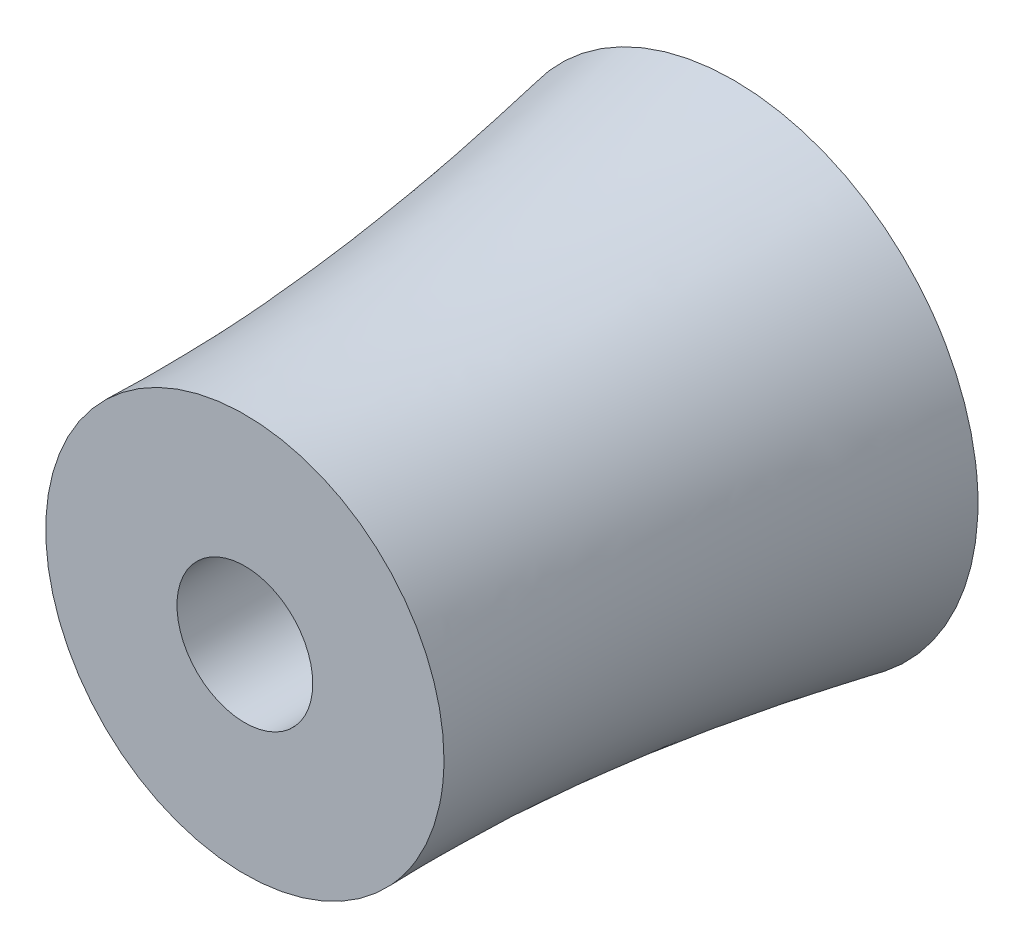
ISO-10303-21;
HEADER;
FILE_DESCRIPTION(('STEP AP214'),'2;1');
FILE_NAME('part.step','',(''),(''),'','','');
FILE_SCHEMA(('AUTOMOTIVE_DESIGN { 1 0 10303 214 1 1 1 1 }'));
ENDSEC;
DATA;
#1=APPLICATION_CONTEXT('core data for automotive mechanical design processes');
#2=APPLICATION_PROTOCOL_DEFINITION('international standard','automotive_design',2000,#1);
#3=PRODUCT_CONTEXT('',#1,'mechanical');
#4=PRODUCT('Part','Part','',(#3));
#5=PRODUCT_RELATED_PRODUCT_CATEGORY('part','',(#4));
#6=PRODUCT_DEFINITION_FORMATION('','',#4);
#7=PRODUCT_DEFINITION_CONTEXT('part definition',#1,'design');
#8=PRODUCT_DEFINITION('design','',#6,#7);
#9=PRODUCT_DEFINITION_SHAPE('','',#8);
#10=(LENGTH_UNIT() NAMED_UNIT(*) SI_UNIT(.MILLI.,.METRE.));
#11=(NAMED_UNIT(*) PLANE_ANGLE_UNIT() SI_UNIT($,.RADIAN.));
#12=(NAMED_UNIT(*) SI_UNIT($,.STERADIAN.) SOLID_ANGLE_UNIT());
#13=UNCERTAINTY_MEASURE_WITH_UNIT(LENGTH_MEASURE(1.E-05),#10,'distance_accuracy_value','');
#14=(GEOMETRIC_REPRESENTATION_CONTEXT(3) GLOBAL_UNCERTAINTY_ASSIGNED_CONTEXT((#13)) GLOBAL_UNIT_ASSIGNED_CONTEXT((#10,
#11,#12)) REPRESENTATION_CONTEXT('',''));
#15=CARTESIAN_POINT('',(0.,0.,0.));
#16=DIRECTION('',(0.,0.,1.));
#17=DIRECTION('',(1.,0.,0.));
#18=AXIS2_PLACEMENT_3D('',#15,#16,#17);
#19=CARTESIAN_POINT('',(0.,0.,0.));
#20=DIRECTION('',(0.,0.,1.));
#21=DIRECTION('',(1.,0.,0.));
#22=AXIS2_PLACEMENT_3D('',#19,#20,#21);
#23=PLANE('',#22);
#24=CARTESIAN_POINT('',(0.,0.,0.));
#25=DIRECTION('',(0.,0.,1.));
#26=DIRECTION('',(1.,0.,0.));
#27=AXIS2_PLACEMENT_3D('',#24,#25,#26);
#28=CIRCLE('',#27,3.75);
#29=CARTESIAN_POINT('',(3.75,0.,0.));
#30=VERTEX_POINT('',#29);
#31=EDGE_CURVE('E46',#30,#30,#28,.T.);
#32=ORIENTED_EDGE('',*,*,#31,.T.);
#33=EDGE_LOOP('',(#32));
#34=FACE_BOUND('',#33,.T.);
#35=CARTESIAN_POINT('',(0.,0.,0.));
#36=DIRECTION('',(0.,0.,1.));
#37=DIRECTION('',(1.,0.,0.));
#38=AXIS2_PLACEMENT_3D('',#35,#36,#37);
#39=CIRCLE('',#38,13.5);
#40=CARTESIAN_POINT('',(-12.7611217587351,-4.40497122110196,0.));
#41=VERTEX_POINT('',#40);
#42=EDGE_CURVE('E11',#41,#41,#39,.T.);
#43=ORIENTED_EDGE('',*,*,#42,.F.);
#44=EDGE_LOOP('',(#43));
#45=FACE_BOUND('',#44,.T.);
#46=ADVANCED_FACE('F33',(#34,#45),#23,.F.);
#47=CARTESIAN_POINT('',(0.,0.,27.));
#48=DIRECTION('',(0.,0.,1.));
#49=DIRECTION('',(1.,0.,0.));
#50=AXIS2_PLACEMENT_3D('',#47,#48,#49);
#51=PLANE('',#50);
#52=CARTESIAN_POINT('',(0.,0.,27.));
#53=DIRECTION('',(0.,0.,1.));
#54=DIRECTION('',(1.,0.,0.));
#55=AXIS2_PLACEMENT_3D('',#52,#53,#54);
#56=CIRCLE('',#55,3.75);
#57=CARTESIAN_POINT('',(3.75,0.,27.));
#58=VERTEX_POINT('',#57);
#59=EDGE_CURVE('E109',#58,#58,#56,.T.);
#60=ORIENTED_EDGE('',*,*,#59,.F.);
#61=EDGE_LOOP('',(#60));
#62=FACE_BOUND('',#61,.T.);
#63=CARTESIAN_POINT('',(0.,0.,27.));
#64=DIRECTION('',(0.,0.,1.));
#65=DIRECTION('',(1.,0.,0.));
#66=AXIS2_PLACEMENT_3D('',#63,#64,#65);
#67=CIRCLE('',#66,11.);
#68=CARTESIAN_POINT('',(-10.2427343961623,4.01078447310167,27.));
#69=VERTEX_POINT('',#68);
#70=EDGE_CURVE('E41',#69,#69,#67,.T.);
#71=ORIENTED_EDGE('',*,*,#70,.T.);
#72=EDGE_LOOP('',(#71));
#73=FACE_BOUND('',#72,.T.);
#74=ADVANCED_FACE('F66',(#62,#73),#51,.T.);
#75=CARTESIAN_POINT('',(-10.2427343961623,4.01078447310167,27.));
#76=CARTESIAN_POINT('',(-12.7611217587351,-4.40497122110196,0.));
#77=CARTESIAN_POINT('',(-2.22116544995897,24.4962532654263,27.));
#78=CARTESIAN_POINT('',(-21.5710642009391,21.1172722963683,0.));
#79=CARTESIAN_POINT('',(18.2643033423657,16.4746843192229,27.));
#80=CARTESIAN_POINT('',(3.95117931653122,29.9272147385722,0.));
#81=CARTESIAN_POINT('',(10.2427343961623,-4.01078447310167,27.));
#82=CARTESIAN_POINT('',(12.7611217587351,4.40497122110196,0.));
#83=CARTESIAN_POINT('',(2.22116544995896,-24.4962532654263,27.));
#84=CARTESIAN_POINT('',(21.5710642009391,-21.1172722963683,0.));
#85=CARTESIAN_POINT('',(-18.2643033423657,-16.474684319223,27.));
#86=CARTESIAN_POINT('',(-3.95117931653122,-29.9272147385722,0.));
#87=CARTESIAN_POINT('',(-10.2427343961623,4.01078447310167,27.));
#88=CARTESIAN_POINT('',(-12.7611217587351,-4.40497122110196,0.));
#89=(BOUNDED_SURFACE() B_SPLINE_SURFACE(3,1,((#75,#76),(#77,#78),(#79,#80),(#81,#82),(#83,#84),
(#85,#86),(#87,#88)),.UNSPECIFIED.,.T.,.F.,.F.) B_SPLINE_SURFACE_WITH_KNOTS((4,3,4),(2,2),(0.,
0.5,1.),(0.,1.),.UNSPECIFIED.) GEOMETRIC_REPRESENTATION_ITEM() RATIONAL_B_SPLINE_SURFACE(((1.,
1.),(0.333333333333333,0.333333333333333),(0.333333333333333,0.333333333333333),(1.,1.),
(0.333333333333333,0.333333333333334),(0.333333333333333,0.333333333333334),(1.,1.))) REPRESENTATION_ITEM('') SURFACE());
#90=CARTESIAN_POINT('',(-10.2427343961623,4.01078447310167,27.));
#91=CARTESIAN_POINT('',(-10.2689675978558,3.92312035128705,26.71875));
#92=CARTESIAN_POINT('',(-10.2952007995492,3.83545622947243,26.4375));
#93=CARTESIAN_POINT('',(-10.3476672029362,3.66012798584319,25.875));
#94=CARTESIAN_POINT('',(-10.3739004046296,3.57246386402857,25.59375));
#95=CARTESIAN_POINT('',(-10.4263668080166,3.39713562039932,25.03125));
#96=CARTESIAN_POINT('',(-10.45260000971,3.3094714985847,24.75));
#97=CARTESIAN_POINT('',(-10.505066413097,3.13414325495546,24.1875));
#98=CARTESIAN_POINT('',(-10.5312996147904,3.04647913314084,23.90625));
#99=CARTESIAN_POINT('',(-10.5837660181774,2.8711508895116,23.34375));
#100=CARTESIAN_POINT('',(-10.6099992198708,2.78348676769698,23.0625));
#101=CARTESIAN_POINT('',(-10.6624656232578,2.60815852406773,22.5));
#102=CARTESIAN_POINT('',(-10.6886988249513,2.52049440225311,22.21875));
#103=CARTESIAN_POINT('',(-10.7411652283382,2.34516615862387,21.65625));
#104=CARTESIAN_POINT('',(-10.7673984300317,2.25750203680925,21.375));
#105=CARTESIAN_POINT('',(-10.8198648334186,2.08217379318001,20.8125));
#106=CARTESIAN_POINT('',(-10.8460980351121,1.99450967136538,20.53125));
#107=CARTESIAN_POINT('',(-10.898564438499,1.81918142773614,19.96875));
#108=CARTESIAN_POINT('',(-10.9247976401925,1.73151730592152,19.6875));
#109=CARTESIAN_POINT('',(-10.9772640435794,1.55618906229228,19.125));
#110=CARTESIAN_POINT('',(-11.0034972452729,1.46852494047766,18.84375));
#111=CARTESIAN_POINT('',(-11.0559636486598,1.29319669684842,18.28125));
#112=CARTESIAN_POINT('',(-11.0821968503533,1.20553257503379,18.));
#113=CARTESIAN_POINT('',(-11.1346632537402,1.03020433140455,17.4375));
#114=CARTESIAN_POINT('',(-11.1608964554337,0.942540209589931,17.15625));
#115=CARTESIAN_POINT('',(-11.2133628588206,0.767211965960689,16.59375));
#116=CARTESIAN_POINT('',(-11.2395960605141,0.679547844146068,16.3125));
#117=CARTESIAN_POINT('',(-11.292062463901,0.504219600516825,15.75));
#118=CARTESIAN_POINT('',(-11.3182956655945,0.416555478702204,15.46875));
#119=CARTESIAN_POINT('',(-11.3707620689814,0.241227235072962,14.90625));
#120=CARTESIAN_POINT('',(-11.3969952706749,0.153563113258341,14.625));
#121=CARTESIAN_POINT('',(-11.4494616740618,-0.0217651303709017,14.0625));
#122=CARTESIAN_POINT('',(-11.4756948757553,-0.109429252185523,13.78125));
#123=CARTESIAN_POINT('',(-11.5281612791422,-0.284757495814765,13.21875));
#124=CARTESIAN_POINT('',(-11.5543944808357,-0.372421617629386,12.9375));
#125=CARTESIAN_POINT('',(-11.6068608842226,-0.547749861258629,12.375));
#126=CARTESIAN_POINT('',(-11.6330940859161,-0.63541398307325,12.09375));
#127=CARTESIAN_POINT('',(-11.685560489303,-0.810742226702492,11.53125));
#128=CARTESIAN_POINT('',(-11.7117936909965,-0.898406348517113,11.25));
#129=CARTESIAN_POINT('',(-11.7642600943834,-1.07373459214636,10.6875));
#130=CARTESIAN_POINT('',(-11.7904932960769,-1.16139871396098,10.40625));
#131=CARTESIAN_POINT('',(-11.8429596994638,-1.33672695759022,9.84375));
#132=CARTESIAN_POINT('',(-11.8691929011573,-1.42439107940484,9.5625));
#133=CARTESIAN_POINT('',(-11.9216593045442,-1.59971932303408,9.));
#134=CARTESIAN_POINT('',(-11.9478925062377,-1.6873834448487,8.71875));
#135=CARTESIAN_POINT('',(-12.0003589096246,-1.86271168847795,8.15625));
#136=CARTESIAN_POINT('',(-12.0265921113181,-1.95037581029257,7.875));
#137=CARTESIAN_POINT('',(-12.079058514705,-2.12570405392181,7.3125));
#138=CARTESIAN_POINT('',(-12.1052917163985,-2.21336817573643,7.03125));
#139=CARTESIAN_POINT('',(-12.1577581197854,-2.38869641936567,6.46875));
#140=CARTESIAN_POINT('',(-12.1839913214789,-2.47636054118029,6.1875));
#141=CARTESIAN_POINT('',(-12.2364577248658,-2.65168878480954,5.625));
#142=CARTESIAN_POINT('',(-12.2626909265593,-2.73935290662416,5.34375));
#143=CARTESIAN_POINT('',(-12.3151573299462,-2.9146811502534,4.78125));
#144=CARTESIAN_POINT('',(-12.3413905316397,-3.00234527206802,4.5));
#145=CARTESIAN_POINT('',(-12.3938569350266,-3.17767351569726,3.9375));
#146=CARTESIAN_POINT('',(-12.4200901367201,-3.26533763751188,3.65625));
#147=CARTESIAN_POINT('',(-12.472556540107,-3.44066588114113,3.09375));
#148=CARTESIAN_POINT('',(-12.4987897418005,-3.52833000295575,2.8125));
#149=CARTESIAN_POINT('',(-12.5512561451874,-3.70365824658499,2.25));
#150=CARTESIAN_POINT('',(-12.5774893468809,-3.79132236839961,1.96875));
#151=CARTESIAN_POINT('',(-12.6299557502678,-3.96665061202885,1.40625));
#152=CARTESIAN_POINT('',(-12.6561889519613,-4.05431473384348,1.125));
#153=CARTESIAN_POINT('',(-12.7086553553482,-4.22964297747272,0.5625));
#154=CARTESIAN_POINT('',(-12.7348885570417,-4.31730709928734,0.28125));
#155=CARTESIAN_POINT('',(-12.7611217587351,-4.40497122110196,0.));
#156=B_SPLINE_CURVE_WITH_KNOTS('',3,(#90,#91,#92,#93,#94,#95,#96,#97,#98,#99,#100,#101,#102,
#103,#104,#105,#106,#107,#108,#109,#110,#111,#112,#113,#114,#115,#116,#117,#118,#119,#120,#121,
#122,#123,#124,#125,#126,#127,#128,#129,#130,#131,#132,#133,#134,#135,#136,#137,#138,#139,#140,
#141,#142,#143,#144,#145,#146,#147,#148,#149,#150,#151,#152,#153,#154,#155),.UNSPECIFIED.,.F.,
.F.,(4,2,2,2,2,2,2,2,2,2,2,2,2,2,2,2,2,2,2,2,2,2,2,2,2,2,2,2,2,2,2,2,4),(0.,0.88728387487972,
1.77456774975944,2.66185162463916,3.54913549951888,4.4364193743986,5.32370324927832,
6.21098712415804,7.09827099903776,7.98555487391748,8.87283874879719,9.76012262367692,
10.6474064985566,11.5346903734364,12.4219742483161,13.3092581231958,14.1965419980755,
15.0838258729552,15.9711097478349,16.8583936227147,17.7456774975944,18.6329613724741,
19.5202452473538,20.4075291222335,21.2948129971133,22.182096871993,23.0693807468727,
23.9566646217524,24.8439484966321,25.7312323715119,26.6185162463916,27.5058001212713,
28.393083996151),.UNSPECIFIED.);
#157=EDGE_CURVE('BSEAM75',#69,#41,#156,.T.);
#158=ORIENTED_EDGE('',*,*,#70,.F.);
#159=ORIENTED_EDGE('',*,*,#42,.T.);
#160=ORIENTED_EDGE('',*,*,#157,.T.);
#161=ORIENTED_EDGE('',*,*,#157,.F.);
#162=EDGE_LOOP('',(#158,#160,#159,#161));
#163=FACE_BOUND('',#162,.T.);
#164=ADVANCED_FACE('F75',(#163),#89,.T.);
#165=CARTESIAN_POINT('',(0.,0.,-9.99999999994061E-05));
#166=DIRECTION('',(0.,0.,1.));
#167=DIRECTION('',(1.,0.,0.));
#168=AXIS2_PLACEMENT_3D('',#165,#166,#167);
#169=CYLINDRICAL_SURFACE('',#168,3.75);
#170=ORIENTED_EDGE('',*,*,#59,.T.);
#171=EDGE_LOOP('',(#170));
#172=FACE_BOUND('',#171,.T.);
#173=ORIENTED_EDGE('',*,*,#31,.F.);
#174=EDGE_LOOP('',(#173));
#175=FACE_BOUND('',#174,.T.);
#176=ADVANCED_FACE('F77',(#172,#175),#169,.F.);
#177=CLOSED_SHELL('',(#46,#74,#164,#176));
#178=MANIFOLD_SOLID_BREP('B2',#177);
#179=ADVANCED_BREP_SHAPE_REPRESENTATION('',(#18,#178),#14);
#180=SHAPE_DEFINITION_REPRESENTATION(#9,#179);
ENDSEC;
END-ISO-10303-21;
